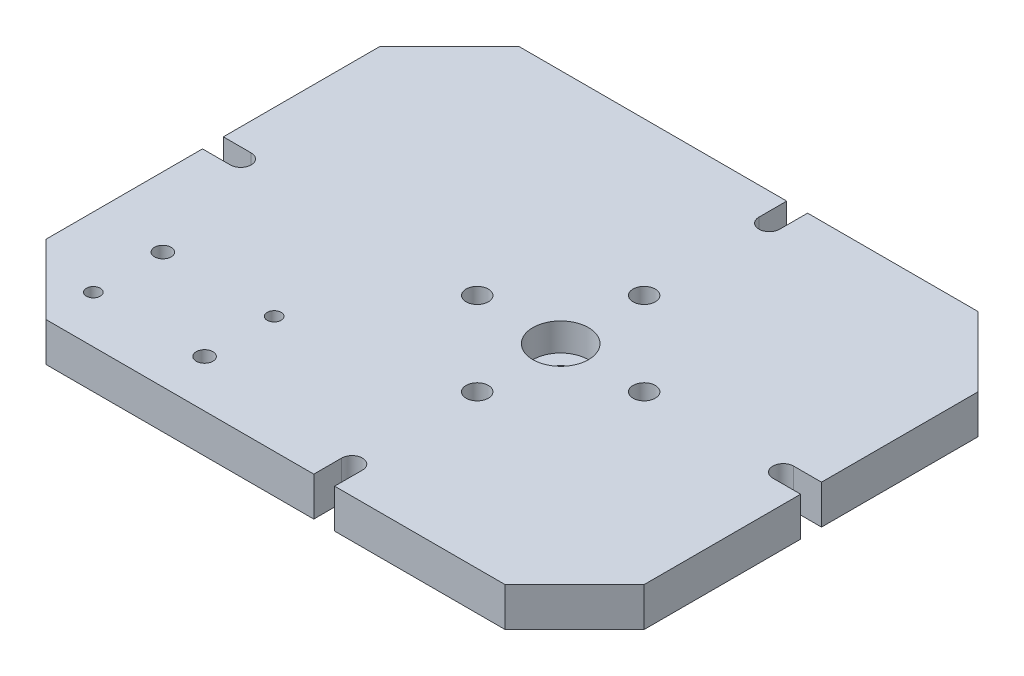
ISO-10303-21;
HEADER;
FILE_DESCRIPTION(('STEP AP214'),'2;1');
FILE_NAME('part.step','',(''),(''),'','','');
FILE_SCHEMA(('AUTOMOTIVE_DESIGN { 1 0 10303 214 1 1 1 1 }'));
ENDSEC;
DATA;
#1=APPLICATION_CONTEXT('core data for automotive mechanical design processes');
#2=APPLICATION_PROTOCOL_DEFINITION('international standard','automotive_design',2000,#1);
#3=PRODUCT_CONTEXT('',#1,'mechanical');
#4=PRODUCT('Part','Part','',(#3));
#5=PRODUCT_RELATED_PRODUCT_CATEGORY('part','',(#4));
#6=PRODUCT_DEFINITION_FORMATION('','',#4);
#7=PRODUCT_DEFINITION_CONTEXT('part definition',#1,'design');
#8=PRODUCT_DEFINITION('design','',#6,#7);
#9=PRODUCT_DEFINITION_SHAPE('','',#8);
#10=(LENGTH_UNIT() NAMED_UNIT(*) SI_UNIT(.MILLI.,.METRE.));
#11=(NAMED_UNIT(*) PLANE_ANGLE_UNIT() SI_UNIT($,.RADIAN.));
#12=(NAMED_UNIT(*) SI_UNIT($,.STERADIAN.) SOLID_ANGLE_UNIT());
#13=UNCERTAINTY_MEASURE_WITH_UNIT(LENGTH_MEASURE(1.E-05),#10,'distance_accuracy_value','');
#14=(GEOMETRIC_REPRESENTATION_CONTEXT(3) GLOBAL_UNCERTAINTY_ASSIGNED_CONTEXT((#13)) GLOBAL_UNIT_ASSIGNED_CONTEXT((#10,
#11,#12)) REPRESENTATION_CONTEXT('',''));
#15=CARTESIAN_POINT('',(0.,0.,0.));
#16=DIRECTION('',(0.,0.,1.));
#17=DIRECTION('',(1.,0.,0.));
#18=AXIS2_PLACEMENT_3D('',#15,#16,#17);
#19=CARTESIAN_POINT('',(50.,28.,0.));
#20=DIRECTION('',(0.,0.,-1.));
#21=DIRECTION('',(-1.,0.,0.));
#22=AXIS2_PLACEMENT_3D('',#19,#20,#21);
#23=PLANE('',#22);
#24=DIRECTION('',(1.,0.,0.));
#25=VECTOR('',#24,1.);
#26=CARTESIAN_POINT('',(50.,0.,0.));
#27=LINE('',#26,#25);
#28=CARTESIAN_POINT('',(50.,0.,0.));
#29=VERTEX_POINT('',#28);
#30=CARTESIAN_POINT('',(242.5,0.,0.));
#31=VERTEX_POINT('',#30);
#32=EDGE_CURVE('E238',#29,#31,#27,.T.);
#33=ORIENTED_EDGE('',*,*,#32,.T.);
#34=DIRECTION('',(0.,-1.,0.));
#35=VECTOR('',#34,1.);
#36=CARTESIAN_POINT('',(242.5,28.,0.));
#37=LINE('',#36,#35);
#38=CARTESIAN_POINT('',(242.5,28.,0.));
#39=VERTEX_POINT('',#38);
#40=EDGE_CURVE('E11',#39,#31,#37,.T.);
#41=ORIENTED_EDGE('',*,*,#40,.F.);
#42=DIRECTION('',(1.,0.,0.));
#43=VECTOR('',#42,1.);
#44=CARTESIAN_POINT('',(50.,28.,0.));
#45=LINE('',#44,#43);
#46=CARTESIAN_POINT('',(50.,28.,0.));
#47=VERTEX_POINT('',#46);
#48=EDGE_CURVE('E285',#47,#39,#45,.T.);
#49=ORIENTED_EDGE('',*,*,#48,.F.);
#50=DIRECTION('',(0.,-1.,0.));
#51=VECTOR('',#50,1.);
#52=CARTESIAN_POINT('',(50.,28.,0.));
#53=LINE('',#52,#51);
#54=EDGE_CURVE('E234',#47,#29,#53,.T.);
#55=ORIENTED_EDGE('',*,*,#54,.T.);
#56=EDGE_LOOP('',(#33,#41,#49,#55));
#57=FACE_BOUND('',#56,.T.);
#58=ADVANCED_FACE('F45',(#57),#23,.F.);
#59=CARTESIAN_POINT('',(242.5,28.,-20.));
#60=DIRECTION('',(-1.,0.,0.));
#61=DIRECTION('',(0.,0.,1.));
#62=AXIS2_PLACEMENT_3D('',#59,#60,#61);
#63=PLANE('',#62);
#64=DIRECTION('',(0.,0.,-1.));
#65=VECTOR('',#64,1.);
#66=CARTESIAN_POINT('',(242.5,0.,-20.));
#67=LINE('',#66,#65);
#68=CARTESIAN_POINT('',(242.5,0.,-20.));
#69=VERTEX_POINT('',#68);
#70=EDGE_CURVE('E241',#31,#69,#67,.T.);
#71=ORIENTED_EDGE('',*,*,#70,.T.);
#72=DIRECTION('',(0.,-1.,0.));
#73=VECTOR('',#72,1.);
#74=CARTESIAN_POINT('',(242.5,28.,-20.));
#75=LINE('',#74,#73);
#76=CARTESIAN_POINT('',(242.5,28.,-20.));
#77=VERTEX_POINT('',#76);
#78=EDGE_CURVE('E54',#77,#69,#75,.T.);
#79=ORIENTED_EDGE('',*,*,#78,.F.);
#80=DIRECTION('',(0.,0.,-1.));
#81=VECTOR('',#80,1.);
#82=CARTESIAN_POINT('',(242.5,28.,-20.));
#83=LINE('',#82,#81);
#84=EDGE_CURVE('E153',#39,#77,#83,.T.);
#85=ORIENTED_EDGE('',*,*,#84,.F.);
#86=ORIENTED_EDGE('',*,*,#40,.T.);
#87=EDGE_LOOP('',(#71,#79,#85,#86));
#88=FACE_BOUND('',#87,.T.);
#89=ADVANCED_FACE('F426',(#88),#63,.F.);
#90=CARTESIAN_POINT('',(250.,28.,-20.));
#91=DIRECTION('',(0.,-1.,0.));
#92=DIRECTION('',(0.,0.,-1.));
#93=AXIS2_PLACEMENT_3D('',#90,#91,#92);
#94=CYLINDRICAL_SURFACE('',#93,7.49999999999997);
#95=CARTESIAN_POINT('',(250.,0.,-20.));
#96=DIRECTION('',(0.,-1.,0.));
#97=DIRECTION('',(0.,0.,1.));
#98=AXIS2_PLACEMENT_3D('',#95,#96,#97);
#99=CIRCLE('',#98,7.49999999999997);
#100=CARTESIAN_POINT('',(257.5,0.,-20.0000000000001));
#101=VERTEX_POINT('',#100);
#102=EDGE_CURVE('E244',#69,#101,#99,.T.);
#103=ORIENTED_EDGE('',*,*,#102,.T.);
#104=DIRECTION('',(0.,-1.,0.));
#105=VECTOR('',#104,1.);
#106=CARTESIAN_POINT('',(257.5,28.,-20.0000000000001));
#107=LINE('',#106,#105);
#108=CARTESIAN_POINT('',(257.5,28.,-20.0000000000001));
#109=VERTEX_POINT('',#108);
#110=EDGE_CURVE('E340',#109,#101,#107,.T.);
#111=ORIENTED_EDGE('',*,*,#110,.F.);
#112=CARTESIAN_POINT('',(250.,28.,-20.));
#113=DIRECTION('',(0.,-1.,0.));
#114=DIRECTION('',(0.,0.,1.));
#115=AXIS2_PLACEMENT_3D('',#112,#113,#114);
#116=CIRCLE('',#115,7.49999999999997);
#117=EDGE_CURVE('E349',#77,#109,#116,.T.);
#118=ORIENTED_EDGE('',*,*,#117,.F.);
#119=ORIENTED_EDGE('',*,*,#78,.T.);
#120=EDGE_LOOP('',(#103,#111,#118,#119));
#121=FACE_BOUND('',#120,.T.);
#122=ADVANCED_FACE('F347',(#121),#94,.F.);
#123=CARTESIAN_POINT('',(257.5,28.,0.));
#124=DIRECTION('',(1.,0.,0.));
#125=DIRECTION('',(0.,0.,-1.));
#126=AXIS2_PLACEMENT_3D('',#123,#124,#125);
#127=PLANE('',#126);
#128=DIRECTION('',(0.,0.,1.));
#129=VECTOR('',#128,1.);
#130=CARTESIAN_POINT('',(257.5,0.,0.));
#131=LINE('',#130,#129);
#132=CARTESIAN_POINT('',(257.5,0.,0.));
#133=VERTEX_POINT('',#132);
#134=EDGE_CURVE('E246',#101,#133,#131,.T.);
#135=ORIENTED_EDGE('',*,*,#134,.T.);
#136=DIRECTION('',(0.,-1.,0.));
#137=VECTOR('',#136,1.);
#138=CARTESIAN_POINT('',(257.5,28.,0.));
#139=LINE('',#138,#137);
#140=CARTESIAN_POINT('',(257.5,28.,0.));
#141=VERTEX_POINT('',#140);
#142=EDGE_CURVE('E337',#141,#133,#139,.T.);
#143=ORIENTED_EDGE('',*,*,#142,.F.);
#144=DIRECTION('',(0.,0.,1.));
#145=VECTOR('',#144,1.);
#146=CARTESIAN_POINT('',(257.5,28.,0.));
#147=LINE('',#146,#145);
#148=EDGE_CURVE('E367',#109,#141,#147,.T.);
#149=ORIENTED_EDGE('',*,*,#148,.F.);
#150=ORIENTED_EDGE('',*,*,#110,.T.);
#151=EDGE_LOOP('',(#135,#143,#149,#150));
#152=FACE_BOUND('',#151,.T.);
#153=ADVANCED_FACE('F358',(#152),#127,.F.);
#154=CARTESIAN_POINT('',(257.5,28.,0.));
#155=DIRECTION('',(0.,0.,-1.));
#156=DIRECTION('',(-1.,0.,0.));
#157=AXIS2_PLACEMENT_3D('',#154,#155,#156);
#158=PLANE('',#157);
#159=DIRECTION('',(1.,0.,0.));
#160=VECTOR('',#159,1.);
#161=CARTESIAN_POINT('',(257.5,0.,0.));
#162=LINE('',#161,#160);
#163=CARTESIAN_POINT('',(380.,0.,0.));
#164=VERTEX_POINT('',#163);
#165=EDGE_CURVE('E248',#133,#164,#162,.T.);
#166=ORIENTED_EDGE('',*,*,#165,.T.);
#167=DIRECTION('',(0.,-1.,0.));
#168=VECTOR('',#167,1.);
#169=CARTESIAN_POINT('',(380.,28.,0.));
#170=LINE('',#169,#168);
#171=CARTESIAN_POINT('',(380.,28.,0.));
#172=VERTEX_POINT('',#171);
#173=EDGE_CURVE('E334',#172,#164,#170,.T.);
#174=ORIENTED_EDGE('',*,*,#173,.F.);
#175=DIRECTION('',(1.,0.,0.));
#176=VECTOR('',#175,1.);
#177=CARTESIAN_POINT('',(257.5,28.,0.));
#178=LINE('',#177,#176);
#179=EDGE_CURVE('E364',#141,#172,#178,.T.);
#180=ORIENTED_EDGE('',*,*,#179,.F.);
#181=ORIENTED_EDGE('',*,*,#142,.T.);
#182=EDGE_LOOP('',(#166,#174,#180,#181));
#183=FACE_BOUND('',#182,.T.);
#184=ADVANCED_FACE('F362',(#183),#158,.F.);
#185=CARTESIAN_POINT('',(380.,28.,0.));
#186=DIRECTION('',(-0.707106781186548,0.,-0.707106781186547));
#187=DIRECTION('',(-0.707106781186547,0.,0.707106781186548));
#188=AXIS2_PLACEMENT_3D('',#185,#186,#187);
#189=PLANE('',#188);
#190=DIRECTION('',(0.707106781186547,0.,-0.707106781186548));
#191=VECTOR('',#190,1.);
#192=CARTESIAN_POINT('',(380.,0.,0.));
#193=LINE('',#192,#191);
#194=CARTESIAN_POINT('',(430.,0.,-50.));
#195=VERTEX_POINT('',#194);
#196=EDGE_CURVE('E250',#164,#195,#193,.T.);
#197=ORIENTED_EDGE('',*,*,#196,.T.);
#198=DIRECTION('',(0.,-1.,0.));
#199=VECTOR('',#198,1.);
#200=CARTESIAN_POINT('',(430.,28.,-50.));
#201=LINE('',#200,#199);
#202=CARTESIAN_POINT('',(430.,28.,-50.));
#203=VERTEX_POINT('',#202);
#204=EDGE_CURVE('E331',#203,#195,#201,.T.);
#205=ORIENTED_EDGE('',*,*,#204,.F.);
#206=DIRECTION('',(0.707106781186547,0.,-0.707106781186548));
#207=VECTOR('',#206,1.);
#208=CARTESIAN_POINT('',(380.,28.,0.));
#209=LINE('',#208,#207);
#210=EDGE_CURVE('E366',#172,#203,#209,.T.);
#211=ORIENTED_EDGE('',*,*,#210,.F.);
#212=ORIENTED_EDGE('',*,*,#173,.T.);
#213=EDGE_LOOP('',(#197,#205,#211,#212));
#214=FACE_BOUND('',#213,.T.);
#215=ADVANCED_FACE('F439',(#214),#189,.F.);
#216=CARTESIAN_POINT('',(430.,28.,-50.));
#217=DIRECTION('',(-1.,0.,0.));
#218=DIRECTION('',(0.,0.,1.));
#219=AXIS2_PLACEMENT_3D('',#216,#217,#218);
#220=PLANE('',#219);
#221=DIRECTION('',(0.,0.,-1.));
#222=VECTOR('',#221,1.);
#223=CARTESIAN_POINT('',(430.,0.,-50.));
#224=LINE('',#223,#222);
#225=CARTESIAN_POINT('',(430.,0.,-162.5));
#226=VERTEX_POINT('',#225);
#227=EDGE_CURVE('E252',#195,#226,#224,.T.);
#228=ORIENTED_EDGE('',*,*,#227,.T.);
#229=DIRECTION('',(0.,-1.,0.));
#230=VECTOR('',#229,1.);
#231=CARTESIAN_POINT('',(430.,28.,-162.5));
#232=LINE('',#231,#230);
#233=CARTESIAN_POINT('',(430.,28.,-162.5));
#234=VERTEX_POINT('',#233);
#235=EDGE_CURVE('E328',#234,#226,#232,.T.);
#236=ORIENTED_EDGE('',*,*,#235,.F.);
#237=DIRECTION('',(0.,0.,-1.));
#238=VECTOR('',#237,1.);
#239=CARTESIAN_POINT('',(430.,28.,-50.));
#240=LINE('',#239,#238);
#241=EDGE_CURVE('E369',#203,#234,#240,.T.);
#242=ORIENTED_EDGE('',*,*,#241,.F.);
#243=ORIENTED_EDGE('',*,*,#204,.T.);
#244=EDGE_LOOP('',(#228,#236,#242,#243));
#245=FACE_BOUND('',#244,.T.);
#246=ADVANCED_FACE('F442',(#245),#220,.F.);
#247=CARTESIAN_POINT('',(410.,28.,-162.5));
#248=DIRECTION('',(0.,0.,1.));
#249=DIRECTION('',(1.,0.,0.));
#250=AXIS2_PLACEMENT_3D('',#247,#248,#249);
#251=PLANE('',#250);
#252=DIRECTION('',(-1.,0.,0.));
#253=VECTOR('',#252,1.);
#254=CARTESIAN_POINT('',(410.,0.,-162.5));
#255=LINE('',#254,#253);
#256=CARTESIAN_POINT('',(410.,0.,-162.5));
#257=VERTEX_POINT('',#256);
#258=EDGE_CURVE('E254',#226,#257,#255,.T.);
#259=ORIENTED_EDGE('',*,*,#258,.T.);
#260=DIRECTION('',(0.,-1.,0.));
#261=VECTOR('',#260,1.);
#262=CARTESIAN_POINT('',(410.,28.,-162.5));
#263=LINE('',#262,#261);
#264=CARTESIAN_POINT('',(410.,28.,-162.5));
#265=VERTEX_POINT('',#264);
#266=EDGE_CURVE('E325',#265,#257,#263,.T.);
#267=ORIENTED_EDGE('',*,*,#266,.F.);
#268=DIRECTION('',(-1.,0.,0.));
#269=VECTOR('',#268,1.);
#270=CARTESIAN_POINT('',(410.,28.,-162.5));
#271=LINE('',#270,#269);
#272=EDGE_CURVE('E375',#234,#265,#271,.T.);
#273=ORIENTED_EDGE('',*,*,#272,.F.);
#274=ORIENTED_EDGE('',*,*,#235,.T.);
#275=EDGE_LOOP('',(#259,#267,#273,#274));
#276=FACE_BOUND('',#275,.T.);
#277=ADVANCED_FACE('F446',(#276),#251,.F.);
#278=CARTESIAN_POINT('',(410.,28.,-170.));
#279=DIRECTION('',(0.,-1.,0.));
#280=DIRECTION('',(0.,0.,-1.));
#281=AXIS2_PLACEMENT_3D('',#278,#279,#280);
#282=CYLINDRICAL_SURFACE('',#281,7.50000000000003);
#283=CARTESIAN_POINT('',(410.,0.,-170.));
#284=DIRECTION('',(0.,-1.,0.));
#285=DIRECTION('',(0.,0.,-1.));
#286=AXIS2_PLACEMENT_3D('',#283,#284,#285);
#287=CIRCLE('',#286,7.50000000000003);
#288=CARTESIAN_POINT('',(410.,0.,-177.5));
#289=VERTEX_POINT('',#288);
#290=EDGE_CURVE('E256',#257,#289,#287,.T.);
#291=ORIENTED_EDGE('',*,*,#290,.T.);
#292=DIRECTION('',(0.,-1.,0.));
#293=VECTOR('',#292,1.);
#294=CARTESIAN_POINT('',(410.,28.,-177.5));
#295=LINE('',#294,#293);
#296=CARTESIAN_POINT('',(410.,28.,-177.5));
#297=VERTEX_POINT('',#296);
#298=EDGE_CURVE('E322',#297,#289,#295,.T.);
#299=ORIENTED_EDGE('',*,*,#298,.F.);
#300=CARTESIAN_POINT('',(410.,28.,-170.));
#301=DIRECTION('',(0.,-1.,0.));
#302=DIRECTION('',(0.,0.,-1.));
#303=AXIS2_PLACEMENT_3D('',#300,#301,#302);
#304=CIRCLE('',#303,7.50000000000003);
#305=EDGE_CURVE('E377',#265,#297,#304,.T.);
#306=ORIENTED_EDGE('',*,*,#305,.F.);
#307=ORIENTED_EDGE('',*,*,#266,.T.);
#308=EDGE_LOOP('',(#291,#299,#306,#307));
#309=FACE_BOUND('',#308,.T.);
#310=ADVANCED_FACE('F450',(#309),#282,.F.);
#311=CARTESIAN_POINT('',(430.,28.,-177.5));
#312=DIRECTION('',(0.,0.,-1.));
#313=DIRECTION('',(-1.,0.,0.));
#314=AXIS2_PLACEMENT_3D('',#311,#312,#313);
#315=PLANE('',#314);
#316=DIRECTION('',(1.,0.,0.));
#317=VECTOR('',#316,1.);
#318=CARTESIAN_POINT('',(430.,0.,-177.5));
#319=LINE('',#318,#317);
#320=CARTESIAN_POINT('',(430.,0.,-177.5));
#321=VERTEX_POINT('',#320);
#322=EDGE_CURVE('E258',#289,#321,#319,.T.);
#323=ORIENTED_EDGE('',*,*,#322,.T.);
#324=DIRECTION('',(0.,-1.,0.));
#325=VECTOR('',#324,1.);
#326=CARTESIAN_POINT('',(430.,28.,-177.5));
#327=LINE('',#326,#325);
#328=CARTESIAN_POINT('',(430.,28.,-177.5));
#329=VERTEX_POINT('',#328);
#330=EDGE_CURVE('E319',#329,#321,#327,.T.);
#331=ORIENTED_EDGE('',*,*,#330,.F.);
#332=DIRECTION('',(1.,0.,0.));
#333=VECTOR('',#332,1.);
#334=CARTESIAN_POINT('',(430.,28.,-177.5));
#335=LINE('',#334,#333);
#336=EDGE_CURVE('E379',#297,#329,#335,.T.);
#337=ORIENTED_EDGE('',*,*,#336,.F.);
#338=ORIENTED_EDGE('',*,*,#298,.T.);
#339=EDGE_LOOP('',(#323,#331,#337,#338));
#340=FACE_BOUND('',#339,.T.);
#341=ADVANCED_FACE('F454',(#340),#315,.F.);
#342=CARTESIAN_POINT('',(430.,28.,-177.5));
#343=DIRECTION('',(-1.,0.,0.));
#344=DIRECTION('',(0.,0.,1.));
#345=AXIS2_PLACEMENT_3D('',#342,#343,#344);
#346=PLANE('',#345);
#347=DIRECTION('',(0.,0.,-1.));
#348=VECTOR('',#347,1.);
#349=CARTESIAN_POINT('',(430.,0.,-177.5));
#350=LINE('',#349,#348);
#351=CARTESIAN_POINT('',(430.,0.,-290.));
#352=VERTEX_POINT('',#351);
#353=EDGE_CURVE('E260',#321,#352,#350,.T.);
#354=ORIENTED_EDGE('',*,*,#353,.T.);
#355=DIRECTION('',(0.,-1.,0.));
#356=VECTOR('',#355,1.);
#357=CARTESIAN_POINT('',(430.,28.,-290.));
#358=LINE('',#357,#356);
#359=CARTESIAN_POINT('',(430.,28.,-290.));
#360=VERTEX_POINT('',#359);
#361=EDGE_CURVE('E316',#360,#352,#358,.T.);
#362=ORIENTED_EDGE('',*,*,#361,.F.);
#363=DIRECTION('',(0.,0.,-1.));
#364=VECTOR('',#363,1.);
#365=CARTESIAN_POINT('',(430.,28.,-177.5));
#366=LINE('',#365,#364);
#367=EDGE_CURVE('E381',#329,#360,#366,.T.);
#368=ORIENTED_EDGE('',*,*,#367,.F.);
#369=ORIENTED_EDGE('',*,*,#330,.T.);
#370=EDGE_LOOP('',(#354,#362,#368,#369));
#371=FACE_BOUND('',#370,.T.);
#372=ADVANCED_FACE('F458',(#371),#346,.F.);
#373=CARTESIAN_POINT('',(430.,28.,-290.));
#374=DIRECTION('',(-0.707106781186548,0.,0.707106781186548));
#375=DIRECTION('',(0.707106781186548,0.,0.707106781186548));
#376=AXIS2_PLACEMENT_3D('',#373,#374,#375);
#377=PLANE('',#376);
#378=DIRECTION('',(-0.707106781186547,0.,-0.707106781186547));
#379=VECTOR('',#378,1.);
#380=CARTESIAN_POINT('',(430.,0.,-290.));
#381=LINE('',#380,#379);
#382=CARTESIAN_POINT('',(380.,0.,-340.));
#383=VERTEX_POINT('',#382);
#384=EDGE_CURVE('E262',#352,#383,#381,.T.);
#385=ORIENTED_EDGE('',*,*,#384,.T.);
#386=DIRECTION('',(0.,-1.,0.));
#387=VECTOR('',#386,1.);
#388=CARTESIAN_POINT('',(380.,28.,-340.));
#389=LINE('',#388,#387);
#390=CARTESIAN_POINT('',(380.,28.,-340.));
#391=VERTEX_POINT('',#390);
#392=EDGE_CURVE('E313',#391,#383,#389,.T.);
#393=ORIENTED_EDGE('',*,*,#392,.F.);
#394=DIRECTION('',(-0.707106781186547,0.,-0.707106781186547));
#395=VECTOR('',#394,1.);
#396=CARTESIAN_POINT('',(430.,28.,-290.));
#397=LINE('',#396,#395);
#398=EDGE_CURVE('E383',#360,#391,#397,.T.);
#399=ORIENTED_EDGE('',*,*,#398,.F.);
#400=ORIENTED_EDGE('',*,*,#361,.T.);
#401=EDGE_LOOP('',(#385,#393,#399,#400));
#402=FACE_BOUND('',#401,.T.);
#403=ADVANCED_FACE('F462',(#402),#377,.F.);
#404=CARTESIAN_POINT('',(257.5,28.,-340.));
#405=DIRECTION('',(0.,0.,1.));
#406=DIRECTION('',(1.,0.,0.));
#407=AXIS2_PLACEMENT_3D('',#404,#405,#406);
#408=PLANE('',#407);
#409=DIRECTION('',(-1.,0.,0.));
#410=VECTOR('',#409,1.);
#411=CARTESIAN_POINT('',(257.5,0.,-340.));
#412=LINE('',#411,#410);
#413=CARTESIAN_POINT('',(257.5,0.,-340.));
#414=VERTEX_POINT('',#413);
#415=EDGE_CURVE('E264',#383,#414,#412,.T.);
#416=ORIENTED_EDGE('',*,*,#415,.T.);
#417=DIRECTION('',(0.,-1.,0.));
#418=VECTOR('',#417,1.);
#419=CARTESIAN_POINT('',(257.5,28.,-340.));
#420=LINE('',#419,#418);
#421=CARTESIAN_POINT('',(257.5,28.,-340.));
#422=VERTEX_POINT('',#421);
#423=EDGE_CURVE('E310',#422,#414,#420,.T.);
#424=ORIENTED_EDGE('',*,*,#423,.F.);
#425=DIRECTION('',(-1.,0.,0.));
#426=VECTOR('',#425,1.);
#427=CARTESIAN_POINT('',(257.5,28.,-340.));
#428=LINE('',#427,#426);
#429=EDGE_CURVE('E385',#391,#422,#428,.T.);
#430=ORIENTED_EDGE('',*,*,#429,.F.);
#431=ORIENTED_EDGE('',*,*,#392,.T.);
#432=EDGE_LOOP('',(#416,#424,#430,#431));
#433=FACE_BOUND('',#432,.T.);
#434=ADVANCED_FACE('F466',(#433),#408,.F.);
#435=CARTESIAN_POINT('',(257.5,28.,-340.));
#436=DIRECTION('',(1.,0.,0.));
#437=DIRECTION('',(0.,0.,-1.));
#438=AXIS2_PLACEMENT_3D('',#435,#436,#437);
#439=PLANE('',#438);
#440=DIRECTION('',(0.,0.,1.));
#441=VECTOR('',#440,1.);
#442=CARTESIAN_POINT('',(257.5,0.,-340.));
#443=LINE('',#442,#441);
#444=CARTESIAN_POINT('',(257.5,0.,-320.));
#445=VERTEX_POINT('',#444);
#446=EDGE_CURVE('E266',#414,#445,#443,.T.);
#447=ORIENTED_EDGE('',*,*,#446,.T.);
#448=DIRECTION('',(0.,-1.,0.));
#449=VECTOR('',#448,1.);
#450=CARTESIAN_POINT('',(257.5,28.,-320.));
#451=LINE('',#450,#449);
#452=CARTESIAN_POINT('',(257.5,28.,-320.));
#453=VERTEX_POINT('',#452);
#454=EDGE_CURVE('E307',#453,#445,#451,.T.);
#455=ORIENTED_EDGE('',*,*,#454,.F.);
#456=DIRECTION('',(0.,0.,1.));
#457=VECTOR('',#456,1.);
#458=CARTESIAN_POINT('',(257.5,28.,-340.));
#459=LINE('',#458,#457);
#460=EDGE_CURVE('E387',#422,#453,#459,.T.);
#461=ORIENTED_EDGE('',*,*,#460,.F.);
#462=ORIENTED_EDGE('',*,*,#423,.T.);
#463=EDGE_LOOP('',(#447,#455,#461,#462));
#464=FACE_BOUND('',#463,.T.);
#465=ADVANCED_FACE('F470',(#464),#439,.F.);
#466=CARTESIAN_POINT('',(250.,28.,-320.));
#467=DIRECTION('',(0.,-1.,0.));
#468=DIRECTION('',(0.,0.,-1.));
#469=AXIS2_PLACEMENT_3D('',#466,#467,#468);
#470=CYLINDRICAL_SURFACE('',#469,7.49999999999999);
#471=CARTESIAN_POINT('',(250.,0.,-320.));
#472=DIRECTION('',(0.,-1.,0.));
#473=DIRECTION('',(0.,0.,1.));
#474=AXIS2_PLACEMENT_3D('',#471,#472,#473);
#475=CIRCLE('',#474,7.49999999999999);
#476=CARTESIAN_POINT('',(242.5,0.,-320.));
#477=VERTEX_POINT('',#476);
#478=EDGE_CURVE('E268',#445,#477,#475,.T.);
#479=ORIENTED_EDGE('',*,*,#478,.T.);
#480=DIRECTION('',(0.,-1.,0.));
#481=VECTOR('',#480,1.);
#482=CARTESIAN_POINT('',(242.5,28.,-320.));
#483=LINE('',#482,#481);
#484=CARTESIAN_POINT('',(242.5,28.,-320.));
#485=VERTEX_POINT('',#484);
#486=EDGE_CURVE('E304',#485,#477,#483,.T.);
#487=ORIENTED_EDGE('',*,*,#486,.F.);
#488=CARTESIAN_POINT('',(250.,28.,-320.));
#489=DIRECTION('',(0.,-1.,0.));
#490=DIRECTION('',(0.,0.,1.));
#491=AXIS2_PLACEMENT_3D('',#488,#489,#490);
#492=CIRCLE('',#491,7.49999999999999);
#493=EDGE_CURVE('E389',#453,#485,#492,.T.);
#494=ORIENTED_EDGE('',*,*,#493,.F.);
#495=ORIENTED_EDGE('',*,*,#454,.T.);
#496=EDGE_LOOP('',(#479,#487,#494,#495));
#497=FACE_BOUND('',#496,.T.);
#498=ADVANCED_FACE('F474',(#497),#470,.F.);
#499=CARTESIAN_POINT('',(242.5,28.,-320.));
#500=DIRECTION('',(-1.,0.,0.));
#501=DIRECTION('',(0.,0.,1.));
#502=AXIS2_PLACEMENT_3D('',#499,#500,#501);
#503=PLANE('',#502);
#504=DIRECTION('',(0.,0.,-1.));
#505=VECTOR('',#504,1.);
#506=CARTESIAN_POINT('',(242.5,0.,-320.));
#507=LINE('',#506,#505);
#508=CARTESIAN_POINT('',(242.5,0.,-340.));
#509=VERTEX_POINT('',#508);
#510=EDGE_CURVE('E270',#477,#509,#507,.T.);
#511=ORIENTED_EDGE('',*,*,#510,.T.);
#512=DIRECTION('',(0.,-1.,0.));
#513=VECTOR('',#512,1.);
#514=CARTESIAN_POINT('',(242.5,28.,-340.));
#515=LINE('',#514,#513);
#516=CARTESIAN_POINT('',(242.5,28.,-340.));
#517=VERTEX_POINT('',#516);
#518=EDGE_CURVE('E301',#517,#509,#515,.T.);
#519=ORIENTED_EDGE('',*,*,#518,.F.);
#520=DIRECTION('',(0.,0.,-1.));
#521=VECTOR('',#520,1.);
#522=CARTESIAN_POINT('',(242.5,28.,-320.));
#523=LINE('',#522,#521);
#524=EDGE_CURVE('E391',#485,#517,#523,.T.);
#525=ORIENTED_EDGE('',*,*,#524,.F.);
#526=ORIENTED_EDGE('',*,*,#486,.T.);
#527=EDGE_LOOP('',(#511,#519,#525,#526));
#528=FACE_BOUND('',#527,.T.);
#529=ADVANCED_FACE('F478',(#528),#503,.F.);
#530=CARTESIAN_POINT('',(50.,28.,-340.));
#531=DIRECTION('',(0.,0.,1.));
#532=DIRECTION('',(1.,0.,0.));
#533=AXIS2_PLACEMENT_3D('',#530,#531,#532);
#534=PLANE('',#533);
#535=DIRECTION('',(-1.,0.,0.));
#536=VECTOR('',#535,1.);
#537=CARTESIAN_POINT('',(50.,0.,-340.));
#538=LINE('',#537,#536);
#539=CARTESIAN_POINT('',(50.,0.,-340.));
#540=VERTEX_POINT('',#539);
#541=EDGE_CURVE('E272',#509,#540,#538,.T.);
#542=ORIENTED_EDGE('',*,*,#541,.T.);
#543=DIRECTION('',(0.,-1.,0.));
#544=VECTOR('',#543,1.);
#545=CARTESIAN_POINT('',(50.,28.,-340.));
#546=LINE('',#545,#544);
#547=CARTESIAN_POINT('',(50.,28.,-340.));
#548=VERTEX_POINT('',#547);
#549=EDGE_CURVE('E298',#548,#540,#546,.T.);
#550=ORIENTED_EDGE('',*,*,#549,.F.);
#551=DIRECTION('',(-1.,0.,0.));
#552=VECTOR('',#551,1.);
#553=CARTESIAN_POINT('',(50.,28.,-340.));
#554=LINE('',#553,#552);
#555=EDGE_CURVE('E393',#517,#548,#554,.T.);
#556=ORIENTED_EDGE('',*,*,#555,.F.);
#557=ORIENTED_EDGE('',*,*,#518,.T.);
#558=EDGE_LOOP('',(#542,#550,#556,#557));
#559=FACE_BOUND('',#558,.T.);
#560=ADVANCED_FACE('F482',(#559),#534,.F.);
#561=CARTESIAN_POINT('',(0.,28.,-290.));
#562=DIRECTION('',(0.707106781186547,0.,0.707106781186548));
#563=DIRECTION('',(0.707106781186548,0.,-0.707106781186547));
#564=AXIS2_PLACEMENT_3D('',#561,#562,#563);
#565=PLANE('',#564);
#566=DIRECTION('',(-0.707106781186548,0.,0.707106781186547));
#567=VECTOR('',#566,1.);
#568=CARTESIAN_POINT('',(0.,0.,-290.));
#569=LINE('',#568,#567);
#570=CARTESIAN_POINT('',(0.,0.,-290.));
#571=VERTEX_POINT('',#570);
#572=EDGE_CURVE('E274',#540,#571,#569,.T.);
#573=ORIENTED_EDGE('',*,*,#572,.T.);
#574=DIRECTION('',(0.,-1.,0.));
#575=VECTOR('',#574,1.);
#576=CARTESIAN_POINT('',(0.,28.,-290.));
#577=LINE('',#576,#575);
#578=CARTESIAN_POINT('',(0.,28.,-290.));
#579=VERTEX_POINT('',#578);
#580=EDGE_CURVE('E295',#579,#571,#577,.T.);
#581=ORIENTED_EDGE('',*,*,#580,.F.);
#582=DIRECTION('',(-0.707106781186548,0.,0.707106781186547));
#583=VECTOR('',#582,1.);
#584=CARTESIAN_POINT('',(0.,28.,-290.));
#585=LINE('',#584,#583);
#586=EDGE_CURVE('E395',#548,#579,#585,.T.);
#587=ORIENTED_EDGE('',*,*,#586,.F.);
#588=ORIENTED_EDGE('',*,*,#549,.T.);
#589=EDGE_LOOP('',(#573,#581,#587,#588));
#590=FACE_BOUND('',#589,.T.);
#591=ADVANCED_FACE('F486',(#590),#565,.F.);
#592=CARTESIAN_POINT('',(0.,28.,-177.5));
#593=DIRECTION('',(1.,0.,0.));
#594=DIRECTION('',(0.,0.,-1.));
#595=AXIS2_PLACEMENT_3D('',#592,#593,#594);
#596=PLANE('',#595);
#597=DIRECTION('',(0.,0.,1.));
#598=VECTOR('',#597,1.);
#599=CARTESIAN_POINT('',(0.,0.,-177.5));
#600=LINE('',#599,#598);
#601=CARTESIAN_POINT('',(0.,0.,-177.5));
#602=VERTEX_POINT('',#601);
#603=EDGE_CURVE('E276',#571,#602,#600,.T.);
#604=ORIENTED_EDGE('',*,*,#603,.T.);
#605=DIRECTION('',(0.,-1.,0.));
#606=VECTOR('',#605,1.);
#607=CARTESIAN_POINT('',(0.,28.,-177.5));
#608=LINE('',#607,#606);
#609=CARTESIAN_POINT('',(0.,28.,-177.5));
#610=VERTEX_POINT('',#609);
#611=EDGE_CURVE('E292',#610,#602,#608,.T.);
#612=ORIENTED_EDGE('',*,*,#611,.F.);
#613=DIRECTION('',(0.,0.,1.));
#614=VECTOR('',#613,1.);
#615=CARTESIAN_POINT('',(0.,28.,-177.5));
#616=LINE('',#615,#614);
#617=EDGE_CURVE('E397',#579,#610,#616,.T.);
#618=ORIENTED_EDGE('',*,*,#617,.F.);
#619=ORIENTED_EDGE('',*,*,#580,.T.);
#620=EDGE_LOOP('',(#604,#612,#618,#619));
#621=FACE_BOUND('',#620,.T.);
#622=ADVANCED_FACE('F490',(#621),#596,.F.);
#623=CARTESIAN_POINT('',(0.,28.,-177.5));
#624=DIRECTION('',(0.,0.,-1.));
#625=DIRECTION('',(-1.,0.,0.));
#626=AXIS2_PLACEMENT_3D('',#623,#624,#625);
#627=PLANE('',#626);
#628=DIRECTION('',(1.,0.,0.));
#629=VECTOR('',#628,1.);
#630=CARTESIAN_POINT('',(0.,0.,-177.5));
#631=LINE('',#630,#629);
#632=CARTESIAN_POINT('',(20.,0.,-177.5));
#633=VERTEX_POINT('',#632);
#634=EDGE_CURVE('E278',#602,#633,#631,.T.);
#635=ORIENTED_EDGE('',*,*,#634,.T.);
#636=DIRECTION('',(0.,-1.,0.));
#637=VECTOR('',#636,1.);
#638=CARTESIAN_POINT('',(20.,28.,-177.5));
#639=LINE('',#638,#637);
#640=CARTESIAN_POINT('',(20.,28.,-177.5));
#641=VERTEX_POINT('',#640);
#642=EDGE_CURVE('E289',#641,#633,#639,.T.);
#643=ORIENTED_EDGE('',*,*,#642,.F.);
#644=DIRECTION('',(1.,0.,0.));
#645=VECTOR('',#644,1.);
#646=CARTESIAN_POINT('',(0.,28.,-177.5));
#647=LINE('',#646,#645);
#648=EDGE_CURVE('E399',#610,#641,#647,.T.);
#649=ORIENTED_EDGE('',*,*,#648,.F.);
#650=ORIENTED_EDGE('',*,*,#611,.T.);
#651=EDGE_LOOP('',(#635,#643,#649,#650));
#652=FACE_BOUND('',#651,.T.);
#653=ADVANCED_FACE('F405',(#652),#627,.F.);
#654=CARTESIAN_POINT('',(20.,28.,-170.));
#655=DIRECTION('',(0.,-1.,0.));
#656=DIRECTION('',(0.,0.,-1.));
#657=AXIS2_PLACEMENT_3D('',#654,#655,#656);
#658=CYLINDRICAL_SURFACE('',#657,7.50000000000003);
#659=CARTESIAN_POINT('',(20.,0.,-170.));
#660=DIRECTION('',(0.,-1.,0.));
#661=DIRECTION('',(0.,0.,1.));
#662=AXIS2_PLACEMENT_3D('',#659,#660,#661);
#663=CIRCLE('',#662,7.50000000000003);
#664=CARTESIAN_POINT('',(20.,0.,-162.5));
#665=VERTEX_POINT('',#664);
#666=EDGE_CURVE('E280',#633,#665,#663,.T.);
#667=ORIENTED_EDGE('',*,*,#666,.T.);
#668=DIRECTION('',(0.,-1.,0.));
#669=VECTOR('',#668,1.);
#670=CARTESIAN_POINT('',(20.,28.,-162.5));
#671=LINE('',#670,#669);
#672=CARTESIAN_POINT('',(20.,28.,-162.5));
#673=VERTEX_POINT('',#672);
#674=EDGE_CURVE('E229',#673,#665,#671,.T.);
#675=ORIENTED_EDGE('',*,*,#674,.F.);
#676=CARTESIAN_POINT('',(20.,28.,-170.));
#677=DIRECTION('',(0.,-1.,0.));
#678=DIRECTION('',(0.,0.,1.));
#679=AXIS2_PLACEMENT_3D('',#676,#677,#678);
#680=CIRCLE('',#679,7.50000000000003);
#681=EDGE_CURVE('E220',#641,#673,#680,.T.);
#682=ORIENTED_EDGE('',*,*,#681,.F.);
#683=ORIENTED_EDGE('',*,*,#642,.T.);
#684=EDGE_LOOP('',(#667,#675,#682,#683));
#685=FACE_BOUND('',#684,.T.);
#686=ADVANCED_FACE('F409',(#685),#658,.F.);
#687=CARTESIAN_POINT('',(20.,28.,-162.5));
#688=DIRECTION('',(0.,0.,1.));
#689=DIRECTION('',(1.,0.,0.));
#690=AXIS2_PLACEMENT_3D('',#687,#688,#689);
#691=PLANE('',#690);
#692=DIRECTION('',(-1.,0.,0.));
#693=VECTOR('',#692,1.);
#694=CARTESIAN_POINT('',(20.,0.,-162.5));
#695=LINE('',#694,#693);
#696=CARTESIAN_POINT('',(0.,0.,-162.5));
#697=VERTEX_POINT('',#696);
#698=EDGE_CURVE('E228',#665,#697,#695,.T.);
#699=ORIENTED_EDGE('',*,*,#698,.T.);
#700=DIRECTION('',(0.,-1.,0.));
#701=VECTOR('',#700,1.);
#702=CARTESIAN_POINT('',(0.,28.,-162.5));
#703=LINE('',#702,#701);
#704=CARTESIAN_POINT('',(0.,28.,-162.5));
#705=VERTEX_POINT('',#704);
#706=EDGE_CURVE('E225',#705,#697,#703,.T.);
#707=ORIENTED_EDGE('',*,*,#706,.F.);
#708=DIRECTION('',(-1.,0.,0.));
#709=VECTOR('',#708,1.);
#710=CARTESIAN_POINT('',(20.,28.,-162.5));
#711=LINE('',#710,#709);
#712=EDGE_CURVE('E214',#673,#705,#711,.T.);
#713=ORIENTED_EDGE('',*,*,#712,.F.);
#714=ORIENTED_EDGE('',*,*,#674,.T.);
#715=EDGE_LOOP('',(#699,#707,#713,#714));
#716=FACE_BOUND('',#715,.T.);
#717=ADVANCED_FACE('F226',(#716),#691,.F.);
#718=CARTESIAN_POINT('',(0.,28.,-50.));
#719=DIRECTION('',(1.,0.,0.));
#720=DIRECTION('',(0.,0.,-1.));
#721=AXIS2_PLACEMENT_3D('',#718,#719,#720);
#722=PLANE('',#721);
#723=DIRECTION('',(0.,0.,1.));
#724=VECTOR('',#723,1.);
#725=CARTESIAN_POINT('',(0.,0.,-50.));
#726=LINE('',#725,#724);
#727=CARTESIAN_POINT('',(0.,0.,-50.));
#728=VERTEX_POINT('',#727);
#729=EDGE_CURVE('E139',#697,#728,#726,.T.);
#730=ORIENTED_EDGE('',*,*,#729,.T.);
#731=DIRECTION('',(0.,-1.,0.));
#732=VECTOR('',#731,1.);
#733=CARTESIAN_POINT('',(0.,28.,-50.));
#734=LINE('',#733,#732);
#735=CARTESIAN_POINT('',(0.,28.,-50.));
#736=VERTEX_POINT('',#735);
#737=EDGE_CURVE('E230',#736,#728,#734,.T.);
#738=ORIENTED_EDGE('',*,*,#737,.F.);
#739=DIRECTION('',(0.,0.,1.));
#740=VECTOR('',#739,1.);
#741=CARTESIAN_POINT('',(0.,28.,-50.));
#742=LINE('',#741,#740);
#743=EDGE_CURVE('E218',#705,#736,#742,.T.);
#744=ORIENTED_EDGE('',*,*,#743,.F.);
#745=ORIENTED_EDGE('',*,*,#706,.T.);
#746=EDGE_LOOP('',(#730,#738,#744,#745));
#747=FACE_BOUND('',#746,.T.);
#748=ADVANCED_FACE('F232',(#747),#722,.F.);
#749=CARTESIAN_POINT('',(0.,28.,-50.));
#750=DIRECTION('',(0.707106781186548,0.,-0.707106781186548));
#751=DIRECTION('',(-0.707106781186548,0.,-0.707106781186548));
#752=AXIS2_PLACEMENT_3D('',#749,#750,#751);
#753=PLANE('',#752);
#754=DIRECTION('',(0.707106781186547,0.,0.707106781186547));
#755=VECTOR('',#754,1.);
#756=CARTESIAN_POINT('',(0.,0.,-50.));
#757=LINE('',#756,#755);
#758=EDGE_CURVE('E145',#728,#29,#757,.T.);
#759=ORIENTED_EDGE('',*,*,#758,.T.);
#760=ORIENTED_EDGE('',*,*,#54,.F.);
#761=DIRECTION('',(0.707106781186547,0.,0.707106781186547));
#762=VECTOR('',#761,1.);
#763=CARTESIAN_POINT('',(0.,28.,-50.));
#764=LINE('',#763,#762);
#765=EDGE_CURVE('E62',#736,#47,#764,.T.);
#766=ORIENTED_EDGE('',*,*,#765,.F.);
#767=ORIENTED_EDGE('',*,*,#737,.T.);
#768=EDGE_LOOP('',(#759,#760,#766,#767));
#769=FACE_BOUND('',#768,.T.);
#770=ADVANCED_FACE('F413',(#769),#753,.F.);
#771=CARTESIAN_POINT('',(250.,28.,-20.));
#772=DIRECTION('',(0.,1.,0.));
#773=DIRECTION('',(0.,0.,1.));
#774=AXIS2_PLACEMENT_3D('',#771,#772,#773);
#775=PLANE('',#774);
#776=CARTESIAN_POINT('',(250.,28.,-169.999999999999));
#777=DIRECTION('',(0.,1.,0.));
#778=DIRECTION('',(0.,0.,1.));
#779=AXIS2_PLACEMENT_3D('',#776,#777,#778);
#780=CIRCLE('',#779,20.);
#781=CARTESIAN_POINT('',(250.,28.,-149.999999999999));
#782=VERTEX_POINT('',#781);
#783=EDGE_CURVE('E646',#782,#782,#780,.T.);
#784=ORIENTED_EDGE('',*,*,#783,.F.);
#785=EDGE_LOOP('',(#784));
#786=FACE_BOUND('',#785,.T.);
#787=CARTESIAN_POINT('',(130.,28.,-84.));
#788=DIRECTION('',(0.,1.,0.));
#789=DIRECTION('',(0.,0.,1.));
#790=AXIS2_PLACEMENT_3D('',#787,#788,#789);
#791=CIRCLE('',#790,5.00000000000002);
#792=CARTESIAN_POINT('',(130.,28.,-79.));
#793=VERTEX_POINT('',#792);
#794=EDGE_CURVE('E661',#793,#793,#791,.T.);
#795=ORIENTED_EDGE('',*,*,#794,.F.);
#796=EDGE_LOOP('',(#795));
#797=FACE_BOUND('',#796,.T.);
#798=CARTESIAN_POINT('',(50.0000000000001,28.,-34.));
#799=DIRECTION('',(0.,1.,0.));
#800=DIRECTION('',(0.,0.,1.));
#801=AXIS2_PLACEMENT_3D('',#798,#799,#800);
#802=CIRCLE('',#801,5.);
#803=CARTESIAN_POINT('',(50.0000000000001,28.,-29.));
#804=VERTEX_POINT('',#803);
#805=EDGE_CURVE('E668',#804,#804,#802,.T.);
#806=ORIENTED_EDGE('',*,*,#805,.F.);
#807=EDGE_LOOP('',(#806));
#808=FACE_BOUND('',#807,.T.);
#809=CARTESIAN_POINT('',(130.,28.,-34.));
#810=DIRECTION('',(0.,1.,0.));
#811=DIRECTION('',(0.,0.,1.));
#812=AXIS2_PLACEMENT_3D('',#809,#810,#811);
#813=CIRCLE('',#812,6.00000000000002);
#814=CARTESIAN_POINT('',(130.,28.,-28.));
#815=VERTEX_POINT('',#814);
#816=EDGE_CURVE('E655',#815,#815,#813,.T.);
#817=ORIENTED_EDGE('',*,*,#816,.F.);
#818=EDGE_LOOP('',(#817));
#819=FACE_BOUND('',#818,.T.);
#820=CARTESIAN_POINT('',(50.0000000000001,28.,-84.));
#821=DIRECTION('',(0.,1.,0.));
#822=DIRECTION('',(0.,0.,1.));
#823=AXIS2_PLACEMENT_3D('',#820,#821,#822);
#824=CIRCLE('',#823,6.);
#825=CARTESIAN_POINT('',(50.0000000000001,28.,-78.));
#826=VERTEX_POINT('',#825);
#827=EDGE_CURVE('E664',#826,#826,#824,.T.);
#828=ORIENTED_EDGE('',*,*,#827,.F.);
#829=EDGE_LOOP('',(#828));
#830=FACE_BOUND('',#829,.T.);
#831=CARTESIAN_POINT('',(250.,28.,-230.));
#832=DIRECTION('',(0.,1.,0.));
#833=DIRECTION('',(0.,0.,1.));
#834=AXIS2_PLACEMENT_3D('',#831,#832,#833);
#835=CIRCLE('',#834,7.99999999999999);
#836=CARTESIAN_POINT('',(250.,28.,-222.));
#837=VERTEX_POINT('',#836);
#838=EDGE_CURVE('E681',#837,#837,#835,.T.);
#839=ORIENTED_EDGE('',*,*,#838,.F.);
#840=EDGE_LOOP('',(#839));
#841=FACE_BOUND('',#840,.T.);
#842=CARTESIAN_POINT('',(190.000000000001,28.,-169.999999999999));
#843=DIRECTION('',(0.,1.,0.));
#844=DIRECTION('',(0.,0.,1.));
#845=AXIS2_PLACEMENT_3D('',#842,#843,#844);
#846=CIRCLE('',#845,7.99999999999999);
#847=CARTESIAN_POINT('',(190.000000000001,28.,-161.999999999999));
#848=VERTEX_POINT('',#847);
#849=EDGE_CURVE('E684',#848,#848,#846,.T.);
#850=ORIENTED_EDGE('',*,*,#849,.F.);
#851=EDGE_LOOP('',(#850));
#852=FACE_BOUND('',#851,.T.);
#853=CARTESIAN_POINT('',(250.000000000002,28.,-110.));
#854=DIRECTION('',(0.,1.,0.));
#855=DIRECTION('',(0.,0.,1.));
#856=AXIS2_PLACEMENT_3D('',#853,#854,#855);
#857=CIRCLE('',#856,8.);
#858=CARTESIAN_POINT('',(250.000000000002,28.,-102.));
#859=VERTEX_POINT('',#858);
#860=EDGE_CURVE('E690',#859,#859,#857,.T.);
#861=ORIENTED_EDGE('',*,*,#860,.F.);
#862=EDGE_LOOP('',(#861));
#863=FACE_BOUND('',#862,.T.);
#864=CARTESIAN_POINT('',(310.000000000001,28.,-170.000000000002));
#865=DIRECTION('',(0.,1.,0.));
#866=DIRECTION('',(0.,0.,1.));
#867=AXIS2_PLACEMENT_3D('',#864,#865,#866);
#868=CIRCLE('',#867,7.99999999999999);
#869=CARTESIAN_POINT('',(310.000000000001,28.,-162.000000000002));
#870=VERTEX_POINT('',#869);
#871=EDGE_CURVE('E696',#870,#870,#868,.T.);
#872=ORIENTED_EDGE('',*,*,#871,.F.);
#873=EDGE_LOOP('',(#872));
#874=FACE_BOUND('',#873,.T.);
#875=ORIENTED_EDGE('',*,*,#48,.T.);
#876=ORIENTED_EDGE('',*,*,#84,.T.);
#877=ORIENTED_EDGE('',*,*,#117,.T.);
#878=ORIENTED_EDGE('',*,*,#148,.T.);
#879=ORIENTED_EDGE('',*,*,#179,.T.);
#880=ORIENTED_EDGE('',*,*,#210,.T.);
#881=ORIENTED_EDGE('',*,*,#241,.T.);
#882=ORIENTED_EDGE('',*,*,#272,.T.);
#883=ORIENTED_EDGE('',*,*,#305,.T.);
#884=ORIENTED_EDGE('',*,*,#336,.T.);
#885=ORIENTED_EDGE('',*,*,#367,.T.);
#886=ORIENTED_EDGE('',*,*,#398,.T.);
#887=ORIENTED_EDGE('',*,*,#429,.T.);
#888=ORIENTED_EDGE('',*,*,#460,.T.);
#889=ORIENTED_EDGE('',*,*,#493,.T.);
#890=ORIENTED_EDGE('',*,*,#524,.T.);
#891=ORIENTED_EDGE('',*,*,#555,.T.);
#892=ORIENTED_EDGE('',*,*,#586,.T.);
#893=ORIENTED_EDGE('',*,*,#617,.T.);
#894=ORIENTED_EDGE('',*,*,#648,.T.);
#895=ORIENTED_EDGE('',*,*,#681,.T.);
#896=ORIENTED_EDGE('',*,*,#712,.T.);
#897=ORIENTED_EDGE('',*,*,#743,.T.);
#898=ORIENTED_EDGE('',*,*,#765,.T.);
#899=EDGE_LOOP('',(#875,#876,#877,#878,#879,#880,#881,#882,#883,#884,#885,#886,#887,#888,#889,
#890,#891,#892,#893,#894,#895,#896,#897,#898));
#900=FACE_BOUND('',#899,.T.);
#901=ADVANCED_FACE('F216',(#786,#797,#808,#819,#830,#841,#852,#863,#874,#900),#775,.T.);
#902=CARTESIAN_POINT('',(250.,0.,-20.));
#903=DIRECTION('',(0.,1.,0.));
#904=DIRECTION('',(0.,0.,1.));
#905=AXIS2_PLACEMENT_3D('',#902,#903,#904);
#906=PLANE('',#905);
#907=CARTESIAN_POINT('',(250.,0.,-169.999999999999));
#908=DIRECTION('',(0.,1.,0.));
#909=DIRECTION('',(0.,0.,1.));
#910=AXIS2_PLACEMENT_3D('',#907,#908,#909);
#911=CIRCLE('',#910,8.99999999999999);
#912=CARTESIAN_POINT('',(250.,0.,-160.999999999999));
#913=VERTEX_POINT('',#912);
#914=EDGE_CURVE('E48',#913,#913,#911,.T.);
#915=ORIENTED_EDGE('',*,*,#914,.T.);
#916=EDGE_LOOP('',(#915));
#917=FACE_BOUND('',#916,.T.);
#918=CARTESIAN_POINT('',(130.,0.,-84.));
#919=DIRECTION('',(0.,1.,0.));
#920=DIRECTION('',(0.,0.,1.));
#921=AXIS2_PLACEMENT_3D('',#918,#919,#920);
#922=CIRCLE('',#921,5.00000000000002);
#923=CARTESIAN_POINT('',(130.,0.,-79.));
#924=VERTEX_POINT('',#923);
#925=EDGE_CURVE('E665',#924,#924,#922,.T.);
#926=ORIENTED_EDGE('',*,*,#925,.T.);
#927=EDGE_LOOP('',(#926));
#928=FACE_BOUND('',#927,.T.);
#929=CARTESIAN_POINT('',(50.0000000000001,0.,-34.));
#930=DIRECTION('',(0.,1.,0.));
#931=DIRECTION('',(0.,0.,1.));
#932=AXIS2_PLACEMENT_3D('',#929,#930,#931);
#933=CIRCLE('',#932,5.);
#934=CARTESIAN_POINT('',(50.0000000000001,0.,-29.));
#935=VERTEX_POINT('',#934);
#936=EDGE_CURVE('E658',#935,#935,#933,.T.);
#937=ORIENTED_EDGE('',*,*,#936,.T.);
#938=EDGE_LOOP('',(#937));
#939=FACE_BOUND('',#938,.T.);
#940=CARTESIAN_POINT('',(130.,0.,-34.));
#941=DIRECTION('',(0.,1.,0.));
#942=DIRECTION('',(0.,0.,1.));
#943=AXIS2_PLACEMENT_3D('',#940,#941,#942);
#944=CIRCLE('',#943,6.00000000000002);
#945=CARTESIAN_POINT('',(130.,0.,-28.));
#946=VERTEX_POINT('',#945);
#947=EDGE_CURVE('E653',#946,#946,#944,.T.);
#948=ORIENTED_EDGE('',*,*,#947,.T.);
#949=EDGE_LOOP('',(#948));
#950=FACE_BOUND('',#949,.T.);
#951=CARTESIAN_POINT('',(50.0000000000001,0.,-84.));
#952=DIRECTION('',(0.,1.,0.));
#953=DIRECTION('',(0.,0.,1.));
#954=AXIS2_PLACEMENT_3D('',#951,#952,#953);
#955=CIRCLE('',#954,6.);
#956=CARTESIAN_POINT('',(50.0000000000001,0.,-78.));
#957=VERTEX_POINT('',#956);
#958=EDGE_CURVE('E673',#957,#957,#955,.T.);
#959=ORIENTED_EDGE('',*,*,#958,.T.);
#960=EDGE_LOOP('',(#959));
#961=FACE_BOUND('',#960,.T.);
#962=CARTESIAN_POINT('',(250.,0.,-230.));
#963=DIRECTION('',(0.,1.,0.));
#964=DIRECTION('',(0.,0.,1.));
#965=AXIS2_PLACEMENT_3D('',#962,#963,#964);
#966=CIRCLE('',#965,7.99999999999999);
#967=CARTESIAN_POINT('',(250.,0.,-222.));
#968=VERTEX_POINT('',#967);
#969=EDGE_CURVE('E242',#968,#968,#966,.T.);
#970=ORIENTED_EDGE('',*,*,#969,.T.);
#971=EDGE_LOOP('',(#970));
#972=FACE_BOUND('',#971,.T.);
#973=CARTESIAN_POINT('',(190.000000000001,0.,-169.999999999999));
#974=DIRECTION('',(0.,1.,0.));
#975=DIRECTION('',(0.,0.,1.));
#976=AXIS2_PLACEMENT_3D('',#973,#974,#975);
#977=CIRCLE('',#976,7.99999999999999);
#978=CARTESIAN_POINT('',(190.000000000001,0.,-161.999999999999));
#979=VERTEX_POINT('',#978);
#980=EDGE_CURVE('E687',#979,#979,#977,.T.);
#981=ORIENTED_EDGE('',*,*,#980,.T.);
#982=EDGE_LOOP('',(#981));
#983=FACE_BOUND('',#982,.T.);
#984=CARTESIAN_POINT('',(250.000000000002,0.,-110.));
#985=DIRECTION('',(0.,1.,0.));
#986=DIRECTION('',(0.,0.,1.));
#987=AXIS2_PLACEMENT_3D('',#984,#985,#986);
#988=CIRCLE('',#987,8.);
#989=CARTESIAN_POINT('',(250.000000000002,0.,-102.));
#990=VERTEX_POINT('',#989);
#991=EDGE_CURVE('E693',#990,#990,#988,.T.);
#992=ORIENTED_EDGE('',*,*,#991,.T.);
#993=EDGE_LOOP('',(#992));
#994=FACE_BOUND('',#993,.T.);
#995=CARTESIAN_POINT('',(310.000000000001,0.,-170.000000000002));
#996=DIRECTION('',(0.,1.,0.));
#997=DIRECTION('',(0.,0.,1.));
#998=AXIS2_PLACEMENT_3D('',#995,#996,#997);
#999=CIRCLE('',#998,7.99999999999999);
#1000=CARTESIAN_POINT('',(310.000000000001,0.,-162.000000000002));
#1001=VERTEX_POINT('',#1000);
#1002=EDGE_CURVE('E676',#1001,#1001,#999,.T.);
#1003=ORIENTED_EDGE('',*,*,#1002,.T.);
#1004=EDGE_LOOP('',(#1003));
#1005=FACE_BOUND('',#1004,.T.);
#1006=ORIENTED_EDGE('',*,*,#32,.F.);
#1007=ORIENTED_EDGE('',*,*,#758,.F.);
#1008=ORIENTED_EDGE('',*,*,#729,.F.);
#1009=ORIENTED_EDGE('',*,*,#698,.F.);
#1010=ORIENTED_EDGE('',*,*,#666,.F.);
#1011=ORIENTED_EDGE('',*,*,#634,.F.);
#1012=ORIENTED_EDGE('',*,*,#603,.F.);
#1013=ORIENTED_EDGE('',*,*,#572,.F.);
#1014=ORIENTED_EDGE('',*,*,#541,.F.);
#1015=ORIENTED_EDGE('',*,*,#510,.F.);
#1016=ORIENTED_EDGE('',*,*,#478,.F.);
#1017=ORIENTED_EDGE('',*,*,#446,.F.);
#1018=ORIENTED_EDGE('',*,*,#415,.F.);
#1019=ORIENTED_EDGE('',*,*,#384,.F.);
#1020=ORIENTED_EDGE('',*,*,#353,.F.);
#1021=ORIENTED_EDGE('',*,*,#322,.F.);
#1022=ORIENTED_EDGE('',*,*,#290,.F.);
#1023=ORIENTED_EDGE('',*,*,#258,.F.);
#1024=ORIENTED_EDGE('',*,*,#227,.F.);
#1025=ORIENTED_EDGE('',*,*,#196,.F.);
#1026=ORIENTED_EDGE('',*,*,#165,.F.);
#1027=ORIENTED_EDGE('',*,*,#134,.F.);
#1028=ORIENTED_EDGE('',*,*,#102,.F.);
#1029=ORIENTED_EDGE('',*,*,#70,.F.);
#1030=EDGE_LOOP('',(#1006,#1007,#1008,#1009,#1010,#1011,#1012,#1013,#1014,#1015,#1016,#1017,
#1018,#1019,#1020,#1021,#1022,#1023,#1024,#1025,#1026,#1027,#1028,#1029));
#1031=FACE_BOUND('',#1030,.T.);
#1032=ADVANCED_FACE('F353',(#917,#928,#939,#950,#961,#972,#983,#994,#1005,#1031),#906,.F.);
#1033=CARTESIAN_POINT('',(310.000000000001,0.,-170.000000000002));
#1034=DIRECTION('',(0.,1.,0.));
#1035=DIRECTION('',(0.,0.,1.));
#1036=AXIS2_PLACEMENT_3D('',#1033,#1034,#1035);
#1037=CYLINDRICAL_SURFACE('',#1036,7.99999999999999);
#1038=ORIENTED_EDGE('',*,*,#1002,.F.);
#1039=EDGE_LOOP('',(#1038));
#1040=FACE_BOUND('',#1039,.T.);
#1041=ORIENTED_EDGE('',*,*,#871,.T.);
#1042=EDGE_LOOP('',(#1041));
#1043=FACE_BOUND('',#1042,.T.);
#1044=ADVANCED_FACE('F531',(#1040,#1043),#1037,.F.);
#1045=CARTESIAN_POINT('',(250.000000000002,0.,-110.));
#1046=DIRECTION('',(0.,1.,0.));
#1047=DIRECTION('',(0.,0.,1.));
#1048=AXIS2_PLACEMENT_3D('',#1045,#1046,#1047);
#1049=CYLINDRICAL_SURFACE('',#1048,8.);
#1050=ORIENTED_EDGE('',*,*,#991,.F.);
#1051=EDGE_LOOP('',(#1050));
#1052=FACE_BOUND('',#1051,.T.);
#1053=ORIENTED_EDGE('',*,*,#860,.T.);
#1054=EDGE_LOOP('',(#1053));
#1055=FACE_BOUND('',#1054,.T.);
#1056=ADVANCED_FACE('F540',(#1052,#1055),#1049,.F.);
#1057=CARTESIAN_POINT('',(190.000000000001,0.,-169.999999999999));
#1058=DIRECTION('',(0.,1.,0.));
#1059=DIRECTION('',(0.,0.,1.));
#1060=AXIS2_PLACEMENT_3D('',#1057,#1058,#1059);
#1061=CYLINDRICAL_SURFACE('',#1060,7.99999999999999);
#1062=ORIENTED_EDGE('',*,*,#980,.F.);
#1063=EDGE_LOOP('',(#1062));
#1064=FACE_BOUND('',#1063,.T.);
#1065=ORIENTED_EDGE('',*,*,#849,.T.);
#1066=EDGE_LOOP('',(#1065));
#1067=FACE_BOUND('',#1066,.T.);
#1068=ADVANCED_FACE('F550',(#1064,#1067),#1061,.F.);
#1069=CARTESIAN_POINT('',(250.,0.,-230.));
#1070=DIRECTION('',(0.,1.,0.));
#1071=DIRECTION('',(0.,0.,1.));
#1072=AXIS2_PLACEMENT_3D('',#1069,#1070,#1071);
#1073=CYLINDRICAL_SURFACE('',#1072,7.99999999999999);
#1074=ORIENTED_EDGE('',*,*,#969,.F.);
#1075=EDGE_LOOP('',(#1074));
#1076=FACE_BOUND('',#1075,.T.);
#1077=ORIENTED_EDGE('',*,*,#838,.T.);
#1078=EDGE_LOOP('',(#1077));
#1079=FACE_BOUND('',#1078,.T.);
#1080=ADVANCED_FACE('F560',(#1076,#1079),#1073,.F.);
#1081=CARTESIAN_POINT('',(50.0000000000001,0.,-84.));
#1082=DIRECTION('',(0.,1.,0.));
#1083=DIRECTION('',(0.,0.,1.));
#1084=AXIS2_PLACEMENT_3D('',#1081,#1082,#1083);
#1085=CYLINDRICAL_SURFACE('',#1084,6.);
#1086=ORIENTED_EDGE('',*,*,#958,.F.);
#1087=EDGE_LOOP('',(#1086));
#1088=FACE_BOUND('',#1087,.T.);
#1089=ORIENTED_EDGE('',*,*,#827,.T.);
#1090=EDGE_LOOP('',(#1089));
#1091=FACE_BOUND('',#1090,.T.);
#1092=ADVANCED_FACE('F570',(#1088,#1091),#1085,.F.);
#1093=CARTESIAN_POINT('',(130.,0.,-34.));
#1094=DIRECTION('',(0.,1.,0.));
#1095=DIRECTION('',(0.,0.,1.));
#1096=AXIS2_PLACEMENT_3D('',#1093,#1094,#1095);
#1097=CYLINDRICAL_SURFACE('',#1096,6.00000000000002);
#1098=ORIENTED_EDGE('',*,*,#947,.F.);
#1099=EDGE_LOOP('',(#1098));
#1100=FACE_BOUND('',#1099,.T.);
#1101=ORIENTED_EDGE('',*,*,#816,.T.);
#1102=EDGE_LOOP('',(#1101));
#1103=FACE_BOUND('',#1102,.T.);
#1104=ADVANCED_FACE('F580',(#1100,#1103),#1097,.F.);
#1105=CARTESIAN_POINT('',(50.0000000000001,0.,-34.));
#1106=DIRECTION('',(0.,1.,0.));
#1107=DIRECTION('',(0.,0.,1.));
#1108=AXIS2_PLACEMENT_3D('',#1105,#1106,#1107);
#1109=CYLINDRICAL_SURFACE('',#1108,5.);
#1110=ORIENTED_EDGE('',*,*,#936,.F.);
#1111=EDGE_LOOP('',(#1110));
#1112=FACE_BOUND('',#1111,.T.);
#1113=ORIENTED_EDGE('',*,*,#805,.T.);
#1114=EDGE_LOOP('',(#1113));
#1115=FACE_BOUND('',#1114,.T.);
#1116=ADVANCED_FACE('F590',(#1112,#1115),#1109,.F.);
#1117=CARTESIAN_POINT('',(130.,0.,-84.));
#1118=DIRECTION('',(0.,1.,0.));
#1119=DIRECTION('',(0.,0.,1.));
#1120=AXIS2_PLACEMENT_3D('',#1117,#1118,#1119);
#1121=CYLINDRICAL_SURFACE('',#1120,5.00000000000002);
#1122=ORIENTED_EDGE('',*,*,#925,.F.);
#1123=EDGE_LOOP('',(#1122));
#1124=FACE_BOUND('',#1123,.T.);
#1125=ORIENTED_EDGE('',*,*,#794,.T.);
#1126=EDGE_LOOP('',(#1125));
#1127=FACE_BOUND('',#1126,.T.);
#1128=ADVANCED_FACE('F600',(#1124,#1127),#1121,.F.);
#1129=CARTESIAN_POINT('',(250.,8.,-169.999999999999));
#1130=DIRECTION('',(0.,1.,0.));
#1131=DIRECTION('',(0.,0.,1.));
#1132=AXIS2_PLACEMENT_3D('',#1129,#1130,#1131);
#1133=CYLINDRICAL_SURFACE('',#1132,20.);
#1134=CARTESIAN_POINT('',(250.,8.,-169.999999999999));
#1135=DIRECTION('',(0.,1.,0.));
#1136=DIRECTION('',(0.,0.,1.));
#1137=AXIS2_PLACEMENT_3D('',#1134,#1135,#1136);
#1138=CIRCLE('',#1137,20.);
#1139=CARTESIAN_POINT('',(250.,8.,-149.999999999999));
#1140=VERTEX_POINT('',#1139);
#1141=EDGE_CURVE('E648',#1140,#1140,#1138,.T.);
#1142=ORIENTED_EDGE('',*,*,#1141,.F.);
#1143=EDGE_LOOP('',(#1142));
#1144=FACE_BOUND('',#1143,.T.);
#1145=ORIENTED_EDGE('',*,*,#783,.T.);
#1146=EDGE_LOOP('',(#1145));
#1147=FACE_BOUND('',#1146,.T.);
#1148=ADVANCED_FACE('F609',(#1144,#1147),#1133,.F.);
#1149=CARTESIAN_POINT('',(250.,8.,-169.999999999999));
#1150=DIRECTION('',(0.,1.,0.));
#1151=DIRECTION('',(0.,0.,1.));
#1152=AXIS2_PLACEMENT_3D('',#1149,#1150,#1151);
#1153=PLANE('',#1152);
#1154=CARTESIAN_POINT('',(250.,8.,-169.999999999999));
#1155=DIRECTION('',(0.,1.,0.));
#1156=DIRECTION('',(0.,0.,1.));
#1157=AXIS2_PLACEMENT_3D('',#1154,#1155,#1156);
#1158=CIRCLE('',#1157,8.99999999999999);
#1159=CARTESIAN_POINT('',(250.,8.,-160.999999999999));
#1160=VERTEX_POINT('',#1159);
#1161=EDGE_CURVE('E643',#1160,#1160,#1158,.T.);
#1162=ORIENTED_EDGE('',*,*,#1161,.F.);
#1163=EDGE_LOOP('',(#1162));
#1164=FACE_BOUND('',#1163,.T.);
#1165=ORIENTED_EDGE('',*,*,#1141,.T.);
#1166=EDGE_LOOP('',(#1165));
#1167=FACE_BOUND('',#1166,.T.);
#1168=ADVANCED_FACE('F618',(#1164,#1167),#1153,.T.);
#1169=CARTESIAN_POINT('',(250.,-12.,-169.999999999999));
#1170=DIRECTION('',(0.,1.,0.));
#1171=DIRECTION('',(0.,0.,1.));
#1172=AXIS2_PLACEMENT_3D('',#1169,#1170,#1171);
#1173=CYLINDRICAL_SURFACE('',#1172,8.99999999999999);
#1174=ORIENTED_EDGE('',*,*,#1161,.T.);
#1175=EDGE_LOOP('',(#1174));
#1176=FACE_BOUND('',#1175,.T.);
#1177=ORIENTED_EDGE('',*,*,#914,.F.);
#1178=EDGE_LOOP('',(#1177));
#1179=FACE_BOUND('',#1178,.T.);
#1180=ADVANCED_FACE('F627',(#1176,#1179),#1173,.F.);
#1181=CLOSED_SHELL('',(#58,#89,#122,#153,#184,#215,#246,#277,#310,#341,#372,#403,#434,#465,#498,
#529,#560,#591,#622,#653,#686,#717,#748,#770,#901,#1032,#1044,#1056,#1068,#1080,#1092,#1104,
#1116,#1128,#1148,#1168,#1180));
#1182=MANIFOLD_SOLID_BREP('B2',#1181);
#1183=ADVANCED_BREP_SHAPE_REPRESENTATION('',(#18,#1182),#14);
#1184=SHAPE_DEFINITION_REPRESENTATION(#9,#1183);
ENDSEC;
END-ISO-10303-21;
